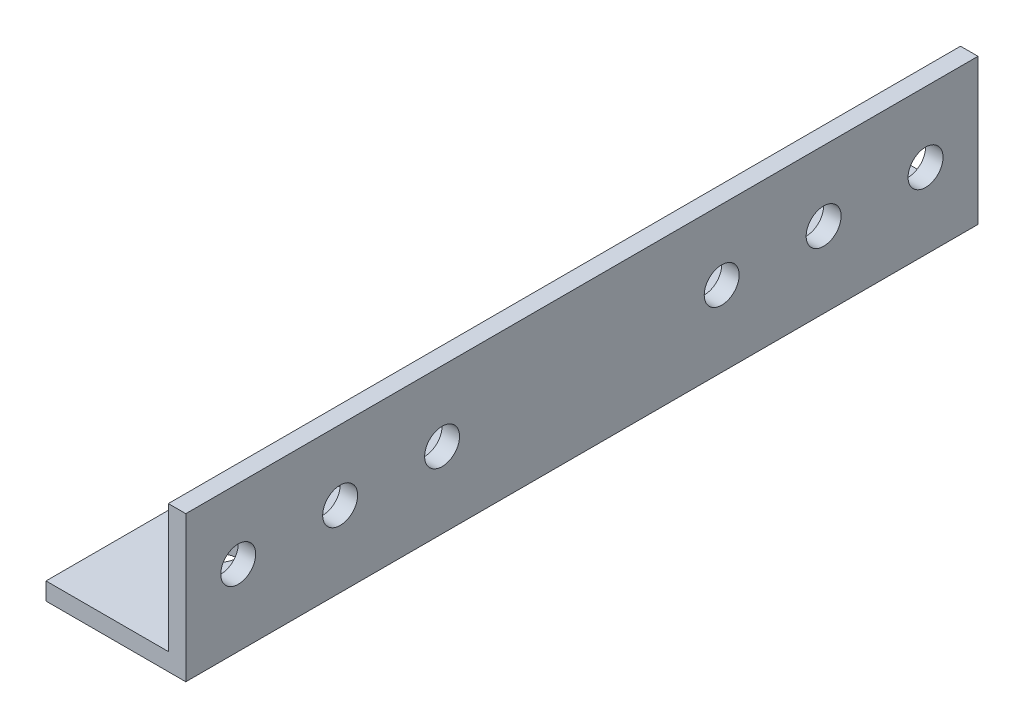
ISO-10303-21;
HEADER;
FILE_DESCRIPTION(('STEP AP214'),'2;1');
FILE_NAME('part.step','',(''),(''),'','','');
FILE_SCHEMA(('AUTOMOTIVE_DESIGN { 1 0 10303 214 1 1 1 1 }'));
ENDSEC;
DATA;
#1=APPLICATION_CONTEXT('core data for automotive mechanical design processes');
#2=APPLICATION_PROTOCOL_DEFINITION('international standard','automotive_design',2000,#1);
#3=PRODUCT_CONTEXT('',#1,'mechanical');
#4=PRODUCT('Part','Part','',(#3));
#5=PRODUCT_RELATED_PRODUCT_CATEGORY('part','',(#4));
#6=PRODUCT_DEFINITION_FORMATION('','',#4);
#7=PRODUCT_DEFINITION_CONTEXT('part definition',#1,'design');
#8=PRODUCT_DEFINITION('design','',#6,#7);
#9=PRODUCT_DEFINITION_SHAPE('','',#8);
#10=(LENGTH_UNIT() NAMED_UNIT(*) SI_UNIT(.MILLI.,.METRE.));
#11=(NAMED_UNIT(*) PLANE_ANGLE_UNIT() SI_UNIT($,.RADIAN.));
#12=(NAMED_UNIT(*) SI_UNIT($,.STERADIAN.) SOLID_ANGLE_UNIT());
#13=UNCERTAINTY_MEASURE_WITH_UNIT(LENGTH_MEASURE(1.E-05),#10,'distance_accuracy_value','');
#14=(GEOMETRIC_REPRESENTATION_CONTEXT(3) GLOBAL_UNCERTAINTY_ASSIGNED_CONTEXT((#13)) GLOBAL_UNIT_ASSIGNED_CONTEXT((#10,
#11,#12)) REPRESENTATION_CONTEXT('',''));
#15=CARTESIAN_POINT('',(0.,0.,0.));
#16=DIRECTION('',(0.,0.,1.));
#17=DIRECTION('',(1.,0.,0.));
#18=AXIS2_PLACEMENT_3D('',#15,#16,#17);
#19=CARTESIAN_POINT('',(0.,3.,136.));
#20=DIRECTION('',(1.,0.,0.));
#21=DIRECTION('',(0.,1.,0.));
#22=AXIS2_PLACEMENT_3D('',#19,#20,#21);
#23=PLANE('',#22);
#24=DIRECTION('',(0.,-1.,0.));
#25=VECTOR('',#24,1.);
#26=CARTESIAN_POINT('',(0.,3.,0.));
#27=LINE('',#26,#25);
#28=CARTESIAN_POINT('',(0.,3.,0.));
#29=VERTEX_POINT('',#28);
#30=CARTESIAN_POINT('',(0.,0.,0.));
#31=VERTEX_POINT('',#30);
#32=EDGE_CURVE('E130',#29,#31,#27,.T.);
#33=ORIENTED_EDGE('',*,*,#32,.T.);
#34=DIRECTION('',(0.,0.,-1.));
#35=VECTOR('',#34,1.);
#36=CARTESIAN_POINT('',(0.,0.,136.));
#37=LINE('',#36,#35);
#38=CARTESIAN_POINT('',(0.,0.,136.));
#39=VERTEX_POINT('',#38);
#40=EDGE_CURVE('E11',#39,#31,#37,.T.);
#41=ORIENTED_EDGE('',*,*,#40,.F.);
#42=DIRECTION('',(0.,-1.,0.));
#43=VECTOR('',#42,1.);
#44=CARTESIAN_POINT('',(0.,3.,136.));
#45=LINE('',#44,#43);
#46=CARTESIAN_POINT('',(0.,3.,136.));
#47=VERTEX_POINT('',#46);
#48=EDGE_CURVE('E147',#47,#39,#45,.T.);
#49=ORIENTED_EDGE('',*,*,#48,.F.);
#50=DIRECTION('',(0.,0.,-1.));
#51=VECTOR('',#50,1.);
#52=CARTESIAN_POINT('',(0.,3.,136.));
#53=LINE('',#52,#51);
#54=EDGE_CURVE('E126',#47,#29,#53,.T.);
#55=ORIENTED_EDGE('',*,*,#54,.T.);
#56=EDGE_LOOP('',(#33,#41,#49,#55));
#57=FACE_BOUND('',#56,.T.);
#58=ADVANCED_FACE('F39',(#57),#23,.F.);
#59=CARTESIAN_POINT('',(0.,0.,136.));
#60=DIRECTION('',(0.,1.,0.));
#61=DIRECTION('',(0.,0.,1.));
#62=AXIS2_PLACEMENT_3D('',#59,#60,#61);
#63=PLANE('',#62);
#64=CARTESIAN_POINT('',(10.,0.,19.8));
#65=DIRECTION('',(0.,-1.,0.));
#66=DIRECTION('',(0.,0.,-1.));
#67=AXIS2_PLACEMENT_3D('',#64,#65,#66);
#68=CIRCLE('',#67,3.);
#69=CARTESIAN_POINT('',(10.,0.,16.8));
#70=VERTEX_POINT('',#69);
#71=EDGE_CURVE('E186',#70,#70,#68,.T.);
#72=ORIENTED_EDGE('',*,*,#71,.F.);
#73=EDGE_LOOP('',(#72));
#74=FACE_BOUND('',#73,.T.);
#75=CARTESIAN_POINT('',(10.,0.,94.));
#76=DIRECTION('',(0.,-1.,0.));
#77=DIRECTION('',(0.,0.,1.));
#78=AXIS2_PLACEMENT_3D('',#75,#76,#77);
#79=CIRCLE('',#78,3.);
#80=CARTESIAN_POINT('',(10.,0.,97.));
#81=VERTEX_POINT('',#80);
#82=EDGE_CURVE('E420',#81,#81,#79,.T.);
#83=ORIENTED_EDGE('',*,*,#82,.F.);
#84=EDGE_LOOP('',(#83));
#85=FACE_BOUND('',#84,.T.);
#86=CARTESIAN_POINT('',(10.,0.,116.2));
#87=DIRECTION('',(0.,-1.,0.));
#88=DIRECTION('',(0.,0.,1.));
#89=AXIS2_PLACEMENT_3D('',#86,#87,#88);
#90=CIRCLE('',#89,3.);
#91=CARTESIAN_POINT('',(10.,0.,119.2));
#92=VERTEX_POINT('',#91);
#93=EDGE_CURVE('E417',#92,#92,#90,.T.);
#94=ORIENTED_EDGE('',*,*,#93,.F.);
#95=EDGE_LOOP('',(#94));
#96=FACE_BOUND('',#95,.T.);
#97=CARTESIAN_POINT('',(10.,0.,42.));
#98=DIRECTION('',(0.,-1.,0.));
#99=DIRECTION('',(0.,0.,-1.));
#100=AXIS2_PLACEMENT_3D('',#97,#98,#99);
#101=CIRCLE('',#100,3.);
#102=CARTESIAN_POINT('',(10.,0.,39.));
#103=VERTEX_POINT('',#102);
#104=EDGE_CURVE('E413',#103,#103,#101,.T.);
#105=ORIENTED_EDGE('',*,*,#104,.F.);
#106=EDGE_LOOP('',(#105));
#107=FACE_BOUND('',#106,.T.);
#108=DIRECTION('',(1.,0.,0.));
#109=VECTOR('',#108,1.);
#110=CARTESIAN_POINT('',(0.,0.,0.));
#111=LINE('',#110,#109);
#112=CARTESIAN_POINT('',(24.,0.,0.));
#113=VERTEX_POINT('',#112);
#114=EDGE_CURVE('E134',#31,#113,#111,.T.);
#115=ORIENTED_EDGE('',*,*,#114,.T.);
#116=DIRECTION('',(0.,0.,-1.));
#117=VECTOR('',#116,1.);
#118=CARTESIAN_POINT('',(24.,0.,136.));
#119=LINE('',#118,#117);
#120=CARTESIAN_POINT('',(24.,0.,136.));
#121=VERTEX_POINT('',#120);
#122=EDGE_CURVE('E49',#121,#113,#119,.T.);
#123=ORIENTED_EDGE('',*,*,#122,.F.);
#124=DIRECTION('',(1.,0.,0.));
#125=VECTOR('',#124,1.);
#126=CARTESIAN_POINT('',(0.,0.,136.));
#127=LINE('',#126,#125);
#128=EDGE_CURVE('E95',#39,#121,#127,.T.);
#129=ORIENTED_EDGE('',*,*,#128,.F.);
#130=ORIENTED_EDGE('',*,*,#40,.T.);
#131=EDGE_LOOP('',(#115,#123,#129,#130));
#132=FACE_BOUND('',#131,.T.);
#133=ADVANCED_FACE('F237',(#74,#85,#96,#107,#132),#63,.F.);
#134=CARTESIAN_POINT('',(24.,0.,136.));
#135=DIRECTION('',(-1.,0.,0.));
#136=DIRECTION('',(0.,0.,1.));
#137=AXIS2_PLACEMENT_3D('',#134,#135,#136);
#138=PLANE('',#137);
#139=CARTESIAN_POINT('',(24.,13.,127.));
#140=DIRECTION('',(1.,0.,0.));
#141=DIRECTION('',(0.,0.,-1.));
#142=AXIS2_PLACEMENT_3D('',#139,#140,#141);
#143=CIRCLE('',#142,3.00000000000001);
#144=CARTESIAN_POINT('',(24.,13.,124.));
#145=VERTEX_POINT('',#144);
#146=EDGE_CURVE('E162',#145,#145,#143,.T.);
#147=ORIENTED_EDGE('',*,*,#146,.F.);
#148=EDGE_LOOP('',(#147));
#149=FACE_BOUND('',#148,.T.);
#150=CARTESIAN_POINT('',(24.,13.,44.));
#151=DIRECTION('',(1.,0.,0.));
#152=DIRECTION('',(0.,0.,1.));
#153=AXIS2_PLACEMENT_3D('',#150,#151,#152);
#154=CIRCLE('',#153,3.00000000000001);
#155=CARTESIAN_POINT('',(24.,13.,47.));
#156=VERTEX_POINT('',#155);
#157=EDGE_CURVE('E196',#156,#156,#154,.T.);
#158=ORIENTED_EDGE('',*,*,#157,.F.);
#159=EDGE_LOOP('',(#158));
#160=FACE_BOUND('',#159,.T.);
#161=CARTESIAN_POINT('',(24.,13.,26.5));
#162=DIRECTION('',(1.,0.,0.));
#163=DIRECTION('',(0.,0.,1.));
#164=AXIS2_PLACEMENT_3D('',#161,#162,#163);
#165=CIRCLE('',#164,3.00000000000001);
#166=CARTESIAN_POINT('',(24.,13.,29.5));
#167=VERTEX_POINT('',#166);
#168=EDGE_CURVE('E201',#167,#167,#165,.T.);
#169=ORIENTED_EDGE('',*,*,#168,.F.);
#170=EDGE_LOOP('',(#169));
#171=FACE_BOUND('',#170,.T.);
#172=CARTESIAN_POINT('',(24.,13.,9.00000000000001));
#173=DIRECTION('',(1.,0.,0.));
#174=DIRECTION('',(0.,0.,1.));
#175=AXIS2_PLACEMENT_3D('',#172,#173,#174);
#176=CIRCLE('',#175,3.00000000000001);
#177=CARTESIAN_POINT('',(24.,13.,12.));
#178=VERTEX_POINT('',#177);
#179=EDGE_CURVE('E207',#178,#178,#176,.T.);
#180=ORIENTED_EDGE('',*,*,#179,.F.);
#181=EDGE_LOOP('',(#180));
#182=FACE_BOUND('',#181,.T.);
#183=CARTESIAN_POINT('',(24.,13.,92.));
#184=DIRECTION('',(1.,0.,0.));
#185=DIRECTION('',(0.,0.,-1.));
#186=AXIS2_PLACEMENT_3D('',#183,#184,#185);
#187=CIRCLE('',#186,3.00000000000001);
#188=CARTESIAN_POINT('',(24.,13.,89.));
#189=VERTEX_POINT('',#188);
#190=EDGE_CURVE('E216',#189,#189,#187,.T.);
#191=ORIENTED_EDGE('',*,*,#190,.F.);
#192=EDGE_LOOP('',(#191));
#193=FACE_BOUND('',#192,.T.);
#194=CARTESIAN_POINT('',(24.,13.,109.5));
#195=DIRECTION('',(1.,0.,0.));
#196=DIRECTION('',(0.,0.,-1.));
#197=AXIS2_PLACEMENT_3D('',#194,#195,#196);
#198=CIRCLE('',#197,3.00000000000001);
#199=CARTESIAN_POINT('',(24.,13.,106.5));
#200=VERTEX_POINT('',#199);
#201=EDGE_CURVE('E212',#200,#200,#198,.T.);
#202=ORIENTED_EDGE('',*,*,#201,.F.);
#203=EDGE_LOOP('',(#202));
#204=FACE_BOUND('',#203,.T.);
#205=DIRECTION('',(0.,1.,0.));
#206=VECTOR('',#205,1.);
#207=CARTESIAN_POINT('',(24.,0.,0.));
#208=LINE('',#207,#206);
#209=CARTESIAN_POINT('',(24.,25.,0.));
#210=VERTEX_POINT('',#209);
#211=EDGE_CURVE('E138',#113,#210,#208,.T.);
#212=ORIENTED_EDGE('',*,*,#211,.T.);
#213=DIRECTION('',(0.,0.,-1.));
#214=VECTOR('',#213,1.);
#215=CARTESIAN_POINT('',(24.,25.,136.));
#216=LINE('',#215,#214);
#217=CARTESIAN_POINT('',(24.,25.,136.));
#218=VERTEX_POINT('',#217);
#219=EDGE_CURVE('E119',#218,#210,#216,.T.);
#220=ORIENTED_EDGE('',*,*,#219,.F.);
#221=DIRECTION('',(0.,1.,0.));
#222=VECTOR('',#221,1.);
#223=CARTESIAN_POINT('',(24.,0.,136.));
#224=LINE('',#223,#222);
#225=EDGE_CURVE('E108',#121,#218,#224,.T.);
#226=ORIENTED_EDGE('',*,*,#225,.F.);
#227=ORIENTED_EDGE('',*,*,#122,.T.);
#228=EDGE_LOOP('',(#212,#220,#226,#227));
#229=FACE_BOUND('',#228,.T.);
#230=ADVANCED_FACE('F234',(#149,#160,#171,#182,#193,#204,#229),#138,.F.);
#231=CARTESIAN_POINT('',(24.,25.,136.));
#232=DIRECTION('',(0.,-1.,0.));
#233=DIRECTION('',(1.,0.,0.));
#234=AXIS2_PLACEMENT_3D('',#231,#232,#233);
#235=PLANE('',#234);
#236=DIRECTION('',(-1.,0.,0.));
#237=VECTOR('',#236,1.);
#238=CARTESIAN_POINT('',(24.,25.,0.));
#239=LINE('',#238,#237);
#240=CARTESIAN_POINT('',(21.,25.,0.));
#241=VERTEX_POINT('',#240);
#242=EDGE_CURVE('E117',#210,#241,#239,.T.);
#243=ORIENTED_EDGE('',*,*,#242,.T.);
#244=DIRECTION('',(0.,0.,-1.));
#245=VECTOR('',#244,1.);
#246=CARTESIAN_POINT('',(21.,25.,136.));
#247=LINE('',#246,#245);
#248=CARTESIAN_POINT('',(21.,25.,136.));
#249=VERTEX_POINT('',#248);
#250=EDGE_CURVE('E114',#249,#241,#247,.T.);
#251=ORIENTED_EDGE('',*,*,#250,.F.);
#252=DIRECTION('',(-1.,0.,0.));
#253=VECTOR('',#252,1.);
#254=CARTESIAN_POINT('',(24.,25.,136.));
#255=LINE('',#254,#253);
#256=EDGE_CURVE('E102',#218,#249,#255,.T.);
#257=ORIENTED_EDGE('',*,*,#256,.F.);
#258=ORIENTED_EDGE('',*,*,#219,.T.);
#259=EDGE_LOOP('',(#243,#251,#257,#258));
#260=FACE_BOUND('',#259,.T.);
#261=ADVANCED_FACE('F115',(#260),#235,.F.);
#262=CARTESIAN_POINT('',(21.,25.,136.));
#263=DIRECTION('',(1.,0.,0.));
#264=DIRECTION('',(0.,1.,0.));
#265=AXIS2_PLACEMENT_3D('',#262,#263,#264);
#266=PLANE('',#265);
#267=CARTESIAN_POINT('',(21.,13.,127.));
#268=DIRECTION('',(1.,0.,0.));
#269=DIRECTION('',(0.,1.,0.));
#270=AXIS2_PLACEMENT_3D('',#267,#268,#269);
#271=CIRCLE('',#270,3.00000000000001);
#272=CARTESIAN_POINT('',(21.,16.,127.));
#273=VERTEX_POINT('',#272);
#274=EDGE_CURVE('E135',#273,#273,#271,.T.);
#275=ORIENTED_EDGE('',*,*,#274,.T.);
#276=EDGE_LOOP('',(#275));
#277=FACE_BOUND('',#276,.T.);
#278=CARTESIAN_POINT('',(21.,13.,44.));
#279=DIRECTION('',(1.,0.,0.));
#280=DIRECTION('',(0.,1.,0.));
#281=AXIS2_PLACEMENT_3D('',#278,#279,#280);
#282=CIRCLE('',#281,3.00000000000001);
#283=CARTESIAN_POINT('',(21.,16.,44.));
#284=VERTEX_POINT('',#283);
#285=EDGE_CURVE('E174',#284,#284,#282,.T.);
#286=ORIENTED_EDGE('',*,*,#285,.T.);
#287=EDGE_LOOP('',(#286));
#288=FACE_BOUND('',#287,.T.);
#289=CARTESIAN_POINT('',(21.,13.,26.5));
#290=DIRECTION('',(1.,0.,0.));
#291=DIRECTION('',(0.,1.,0.));
#292=AXIS2_PLACEMENT_3D('',#289,#290,#291);
#293=CIRCLE('',#292,3.00000000000001);
#294=CARTESIAN_POINT('',(21.,16.,26.5));
#295=VERTEX_POINT('',#294);
#296=EDGE_CURVE('E170',#295,#295,#293,.T.);
#297=ORIENTED_EDGE('',*,*,#296,.T.);
#298=EDGE_LOOP('',(#297));
#299=FACE_BOUND('',#298,.T.);
#300=CARTESIAN_POINT('',(21.,13.,9.00000000000001));
#301=DIRECTION('',(1.,0.,0.));
#302=DIRECTION('',(0.,1.,0.));
#303=AXIS2_PLACEMENT_3D('',#300,#301,#302);
#304=CIRCLE('',#303,3.00000000000001);
#305=CARTESIAN_POINT('',(21.,16.,9.00000000000001));
#306=VERTEX_POINT('',#305);
#307=EDGE_CURVE('E166',#306,#306,#304,.T.);
#308=ORIENTED_EDGE('',*,*,#307,.T.);
#309=EDGE_LOOP('',(#308));
#310=FACE_BOUND('',#309,.T.);
#311=CARTESIAN_POINT('',(21.,13.,92.));
#312=DIRECTION('',(1.,0.,0.));
#313=DIRECTION('',(0.,1.,0.));
#314=AXIS2_PLACEMENT_3D('',#311,#312,#313);
#315=CIRCLE('',#314,3.00000000000001);
#316=CARTESIAN_POINT('',(21.,16.,92.));
#317=VERTEX_POINT('',#316);
#318=EDGE_CURVE('E161',#317,#317,#315,.T.);
#319=ORIENTED_EDGE('',*,*,#318,.T.);
#320=EDGE_LOOP('',(#319));
#321=FACE_BOUND('',#320,.T.);
#322=CARTESIAN_POINT('',(21.,13.,109.5));
#323=DIRECTION('',(1.,0.,0.));
#324=DIRECTION('',(0.,1.,0.));
#325=AXIS2_PLACEMENT_3D('',#322,#323,#324);
#326=CIRCLE('',#325,3.00000000000001);
#327=CARTESIAN_POINT('',(21.,16.,109.5));
#328=VERTEX_POINT('',#327);
#329=EDGE_CURVE('E157',#328,#328,#326,.T.);
#330=ORIENTED_EDGE('',*,*,#329,.T.);
#331=EDGE_LOOP('',(#330));
#332=FACE_BOUND('',#331,.T.);
#333=DIRECTION('',(0.,-1.,0.));
#334=VECTOR('',#333,1.);
#335=CARTESIAN_POINT('',(21.,25.,0.));
#336=LINE('',#335,#334);
#337=CARTESIAN_POINT('',(21.,3.,0.));
#338=VERTEX_POINT('',#337);
#339=EDGE_CURVE('E81',#241,#338,#336,.T.);
#340=ORIENTED_EDGE('',*,*,#339,.T.);
#341=DIRECTION('',(0.,0.,-1.));
#342=VECTOR('',#341,1.);
#343=CARTESIAN_POINT('',(21.,3.,136.));
#344=LINE('',#343,#342);
#345=CARTESIAN_POINT('',(21.,3.,136.));
#346=VERTEX_POINT('',#345);
#347=EDGE_CURVE('E120',#346,#338,#344,.T.);
#348=ORIENTED_EDGE('',*,*,#347,.F.);
#349=DIRECTION('',(0.,-1.,0.));
#350=VECTOR('',#349,1.);
#351=CARTESIAN_POINT('',(21.,25.,136.));
#352=LINE('',#351,#350);
#353=EDGE_CURVE('E106',#249,#346,#352,.T.);
#354=ORIENTED_EDGE('',*,*,#353,.F.);
#355=ORIENTED_EDGE('',*,*,#250,.T.);
#356=EDGE_LOOP('',(#340,#348,#354,#355));
#357=FACE_BOUND('',#356,.T.);
#358=ADVANCED_FACE('F122',(#277,#288,#299,#310,#321,#332,#357),#266,.F.);
#359=CARTESIAN_POINT('',(21.,3.,136.));
#360=DIRECTION('',(0.,-1.,0.));
#361=DIRECTION('',(1.,0.,0.));
#362=AXIS2_PLACEMENT_3D('',#359,#360,#361);
#363=PLANE('',#362);
#364=CARTESIAN_POINT('',(10.,3.,19.8));
#365=DIRECTION('',(0.,-1.,0.));
#366=DIRECTION('',(1.,0.,0.));
#367=AXIS2_PLACEMENT_3D('',#364,#365,#366);
#368=CIRCLE('',#367,3.);
#369=CARTESIAN_POINT('',(13.,3.,19.8));
#370=VERTEX_POINT('',#369);
#371=EDGE_CURVE('E42',#370,#370,#368,.T.);
#372=ORIENTED_EDGE('',*,*,#371,.T.);
#373=EDGE_LOOP('',(#372));
#374=FACE_BOUND('',#373,.T.);
#375=CARTESIAN_POINT('',(10.,3.,94.));
#376=DIRECTION('',(0.,-1.,0.));
#377=DIRECTION('',(1.,0.,0.));
#378=AXIS2_PLACEMENT_3D('',#375,#376,#377);
#379=CIRCLE('',#378,3.);
#380=CARTESIAN_POINT('',(13.,3.,94.));
#381=VERTEX_POINT('',#380);
#382=EDGE_CURVE('E189',#381,#381,#379,.T.);
#383=ORIENTED_EDGE('',*,*,#382,.T.);
#384=EDGE_LOOP('',(#383));
#385=FACE_BOUND('',#384,.T.);
#386=CARTESIAN_POINT('',(10.,3.,116.2));
#387=DIRECTION('',(0.,-1.,0.));
#388=DIRECTION('',(1.,0.,0.));
#389=AXIS2_PLACEMENT_3D('',#386,#387,#388);
#390=CIRCLE('',#389,3.);
#391=CARTESIAN_POINT('',(13.,3.,116.2));
#392=VERTEX_POINT('',#391);
#393=EDGE_CURVE('E185',#392,#392,#390,.T.);
#394=ORIENTED_EDGE('',*,*,#393,.T.);
#395=EDGE_LOOP('',(#394));
#396=FACE_BOUND('',#395,.T.);
#397=CARTESIAN_POINT('',(10.,3.,42.));
#398=DIRECTION('',(0.,-1.,0.));
#399=DIRECTION('',(1.,0.,0.));
#400=AXIS2_PLACEMENT_3D('',#397,#398,#399);
#401=CIRCLE('',#400,3.);
#402=CARTESIAN_POINT('',(13.,3.,42.));
#403=VERTEX_POINT('',#402);
#404=EDGE_CURVE('E181',#403,#403,#401,.T.);
#405=ORIENTED_EDGE('',*,*,#404,.T.);
#406=EDGE_LOOP('',(#405));
#407=FACE_BOUND('',#406,.T.);
#408=DIRECTION('',(-1.,0.,0.));
#409=VECTOR('',#408,1.);
#410=CARTESIAN_POINT('',(21.,3.,0.));
#411=LINE('',#410,#409);
#412=EDGE_CURVE('E87',#338,#29,#411,.T.);
#413=ORIENTED_EDGE('',*,*,#412,.T.);
#414=ORIENTED_EDGE('',*,*,#54,.F.);
#415=DIRECTION('',(-1.,0.,0.));
#416=VECTOR('',#415,1.);
#417=CARTESIAN_POINT('',(21.,3.,136.));
#418=LINE('',#417,#416);
#419=EDGE_CURVE('E58',#346,#47,#418,.T.);
#420=ORIENTED_EDGE('',*,*,#419,.F.);
#421=ORIENTED_EDGE('',*,*,#347,.T.);
#422=EDGE_LOOP('',(#413,#414,#420,#421));
#423=FACE_BOUND('',#422,.T.);
#424=ADVANCED_FACE('F255',(#374,#385,#396,#407,#423),#363,.F.);
#425=CARTESIAN_POINT('',(0.,0.,136.));
#426=DIRECTION('',(0.,0.,1.));
#427=DIRECTION('',(1.,0.,0.));
#428=AXIS2_PLACEMENT_3D('',#425,#426,#427);
#429=PLANE('',#428);
#430=ORIENTED_EDGE('',*,*,#48,.T.);
#431=ORIENTED_EDGE('',*,*,#128,.T.);
#432=ORIENTED_EDGE('',*,*,#225,.T.);
#433=ORIENTED_EDGE('',*,*,#256,.T.);
#434=ORIENTED_EDGE('',*,*,#353,.T.);
#435=ORIENTED_EDGE('',*,*,#419,.T.);
#436=EDGE_LOOP('',(#430,#431,#432,#433,#434,#435));
#437=FACE_BOUND('',#436,.T.);
#438=ADVANCED_FACE('F104',(#437),#429,.T.);
#439=CARTESIAN_POINT('',(0.,0.,0.));
#440=DIRECTION('',(0.,0.,1.));
#441=DIRECTION('',(1.,0.,0.));
#442=AXIS2_PLACEMENT_3D('',#439,#440,#441);
#443=PLANE('',#442);
#444=ORIENTED_EDGE('',*,*,#32,.F.);
#445=ORIENTED_EDGE('',*,*,#412,.F.);
#446=ORIENTED_EDGE('',*,*,#339,.F.);
#447=ORIENTED_EDGE('',*,*,#242,.F.);
#448=ORIENTED_EDGE('',*,*,#211,.F.);
#449=ORIENTED_EDGE('',*,*,#114,.F.);
#450=EDGE_LOOP('',(#444,#445,#446,#447,#448,#449));
#451=FACE_BOUND('',#450,.T.);
#452=ADVANCED_FACE('F251',(#451),#443,.F.);
#453=CARTESIAN_POINT('',(0.,13.,109.5));
#454=DIRECTION('',(1.,0.,0.));
#455=DIRECTION('',(0.,0.,-1.));
#456=AXIS2_PLACEMENT_3D('',#453,#454,#455);
#457=CYLINDRICAL_SURFACE('',#456,3.00000000000001);
#458=ORIENTED_EDGE('',*,*,#201,.T.);
#459=EDGE_LOOP('',(#458));
#460=FACE_BOUND('',#459,.T.);
#461=ORIENTED_EDGE('',*,*,#329,.F.);
#462=EDGE_LOOP('',(#461));
#463=FACE_BOUND('',#462,.T.);
#464=ADVANCED_FACE('F295',(#460,#463),#457,.F.);
#465=CARTESIAN_POINT('',(0.,13.,92.));
#466=DIRECTION('',(1.,0.,0.));
#467=DIRECTION('',(0.,0.,-1.));
#468=AXIS2_PLACEMENT_3D('',#465,#466,#467);
#469=CYLINDRICAL_SURFACE('',#468,3.00000000000001);
#470=ORIENTED_EDGE('',*,*,#190,.T.);
#471=EDGE_LOOP('',(#470));
#472=FACE_BOUND('',#471,.T.);
#473=ORIENTED_EDGE('',*,*,#318,.F.);
#474=EDGE_LOOP('',(#473));
#475=FACE_BOUND('',#474,.T.);
#476=ADVANCED_FACE('F300',(#472,#475),#469,.F.);
#477=CARTESIAN_POINT('',(0.,13.,9.00000000000001));
#478=DIRECTION('',(1.,0.,0.));
#479=DIRECTION('',(0.,0.,-1.));
#480=AXIS2_PLACEMENT_3D('',#477,#478,#479);
#481=CYLINDRICAL_SURFACE('',#480,3.00000000000001);
#482=ORIENTED_EDGE('',*,*,#179,.T.);
#483=EDGE_LOOP('',(#482));
#484=FACE_BOUND('',#483,.T.);
#485=ORIENTED_EDGE('',*,*,#307,.F.);
#486=EDGE_LOOP('',(#485));
#487=FACE_BOUND('',#486,.T.);
#488=ADVANCED_FACE('F312',(#484,#487),#481,.F.);
#489=CARTESIAN_POINT('',(0.,13.,26.5));
#490=DIRECTION('',(1.,0.,0.));
#491=DIRECTION('',(0.,0.,-1.));
#492=AXIS2_PLACEMENT_3D('',#489,#490,#491);
#493=CYLINDRICAL_SURFACE('',#492,3.00000000000001);
#494=ORIENTED_EDGE('',*,*,#168,.T.);
#495=EDGE_LOOP('',(#494));
#496=FACE_BOUND('',#495,.T.);
#497=ORIENTED_EDGE('',*,*,#296,.F.);
#498=EDGE_LOOP('',(#497));
#499=FACE_BOUND('',#498,.T.);
#500=ADVANCED_FACE('F322',(#496,#499),#493,.F.);
#501=CARTESIAN_POINT('',(0.,13.,44.));
#502=DIRECTION('',(1.,0.,0.));
#503=DIRECTION('',(0.,0.,-1.));
#504=AXIS2_PLACEMENT_3D('',#501,#502,#503);
#505=CYLINDRICAL_SURFACE('',#504,3.00000000000001);
#506=ORIENTED_EDGE('',*,*,#157,.T.);
#507=EDGE_LOOP('',(#506));
#508=FACE_BOUND('',#507,.T.);
#509=ORIENTED_EDGE('',*,*,#285,.F.);
#510=EDGE_LOOP('',(#509));
#511=FACE_BOUND('',#510,.T.);
#512=ADVANCED_FACE('F332',(#508,#511),#505,.F.);
#513=CARTESIAN_POINT('',(0.,13.,127.));
#514=DIRECTION('',(1.,0.,0.));
#515=DIRECTION('',(0.,0.,-1.));
#516=AXIS2_PLACEMENT_3D('',#513,#514,#515);
#517=CYLINDRICAL_SURFACE('',#516,3.00000000000001);
#518=ORIENTED_EDGE('',*,*,#146,.T.);
#519=EDGE_LOOP('',(#518));
#520=FACE_BOUND('',#519,.T.);
#521=ORIENTED_EDGE('',*,*,#274,.F.);
#522=EDGE_LOOP('',(#521));
#523=FACE_BOUND('',#522,.T.);
#524=ADVANCED_FACE('F231',(#520,#523),#517,.F.);
#525=CARTESIAN_POINT('',(10.,25.,42.));
#526=DIRECTION('',(0.,-1.,0.));
#527=DIRECTION('',(0.,0.,-1.));
#528=AXIS2_PLACEMENT_3D('',#525,#526,#527);
#529=CYLINDRICAL_SURFACE('',#528,3.);
#530=ORIENTED_EDGE('',*,*,#104,.T.);
#531=EDGE_LOOP('',(#530));
#532=FACE_BOUND('',#531,.T.);
#533=ORIENTED_EDGE('',*,*,#404,.F.);
#534=EDGE_LOOP('',(#533));
#535=FACE_BOUND('',#534,.T.);
#536=ADVANCED_FACE('F349',(#532,#535),#529,.F.);
#537=CARTESIAN_POINT('',(10.,25.,116.2));
#538=DIRECTION('',(0.,-1.,0.));
#539=DIRECTION('',(0.,0.,-1.));
#540=AXIS2_PLACEMENT_3D('',#537,#538,#539);
#541=CYLINDRICAL_SURFACE('',#540,3.);
#542=ORIENTED_EDGE('',*,*,#93,.T.);
#543=EDGE_LOOP('',(#542));
#544=FACE_BOUND('',#543,.T.);
#545=ORIENTED_EDGE('',*,*,#393,.F.);
#546=EDGE_LOOP('',(#545));
#547=FACE_BOUND('',#546,.T.);
#548=ADVANCED_FACE('F368',(#544,#547),#541,.F.);
#549=CARTESIAN_POINT('',(10.,25.,94.));
#550=DIRECTION('',(0.,-1.,0.));
#551=DIRECTION('',(0.,0.,-1.));
#552=AXIS2_PLACEMENT_3D('',#549,#550,#551);
#553=CYLINDRICAL_SURFACE('',#552,3.);
#554=ORIENTED_EDGE('',*,*,#82,.T.);
#555=EDGE_LOOP('',(#554));
#556=FACE_BOUND('',#555,.T.);
#557=ORIENTED_EDGE('',*,*,#382,.F.);
#558=EDGE_LOOP('',(#557));
#559=FACE_BOUND('',#558,.T.);
#560=ADVANCED_FACE('F378',(#556,#559),#553,.F.);
#561=CARTESIAN_POINT('',(10.,25.,19.8));
#562=DIRECTION('',(0.,-1.,0.));
#563=DIRECTION('',(0.,0.,-1.));
#564=AXIS2_PLACEMENT_3D('',#561,#562,#563);
#565=CYLINDRICAL_SURFACE('',#564,3.);
#566=ORIENTED_EDGE('',*,*,#71,.T.);
#567=EDGE_LOOP('',(#566));
#568=FACE_BOUND('',#567,.T.);
#569=ORIENTED_EDGE('',*,*,#371,.F.);
#570=EDGE_LOOP('',(#569));
#571=FACE_BOUND('',#570,.T.);
#572=ADVANCED_FACE('F388',(#568,#571),#565,.F.);
#573=CLOSED_SHELL('',(#58,#133,#230,#261,#358,#424,#438,#452,#464,#476,#488,#500,#512,#524,#536,
#548,#560,#572));
#574=MANIFOLD_SOLID_BREP('B2',#573);
#575=ADVANCED_BREP_SHAPE_REPRESENTATION('',(#18,#574),#14);
#576=SHAPE_DEFINITION_REPRESENTATION(#9,#575);
ENDSEC;
END-ISO-10303-21;
